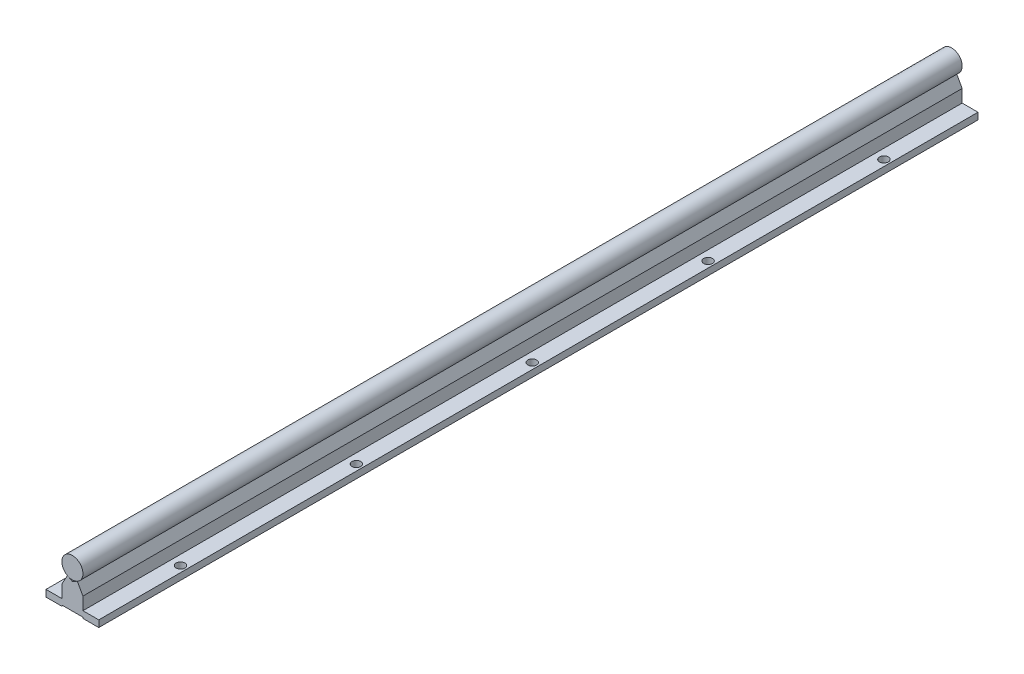
ISO-10303-21;
HEADER;
FILE_DESCRIPTION(('STEP AP214'),'2;1');
FILE_NAME('part.step','',(''),(''),'','','');
FILE_SCHEMA(('AUTOMOTIVE_DESIGN { 1 0 10303 214 1 1 1 1 }'));
ENDSEC;
DATA;
#1=APPLICATION_CONTEXT('core data for automotive mechanical design processes');
#2=APPLICATION_PROTOCOL_DEFINITION('international standard','automotive_design',2000,#1);
#3=PRODUCT_CONTEXT('',#1,'mechanical');
#4=PRODUCT('Part','Part','',(#3));
#5=PRODUCT_RELATED_PRODUCT_CATEGORY('part','',(#4));
#6=PRODUCT_DEFINITION_FORMATION('','',#4);
#7=PRODUCT_DEFINITION_CONTEXT('part definition',#1,'design');
#8=PRODUCT_DEFINITION('design','',#6,#7);
#9=PRODUCT_DEFINITION_SHAPE('','',#8);
#10=(LENGTH_UNIT() NAMED_UNIT(*) SI_UNIT(.MILLI.,.METRE.));
#11=(NAMED_UNIT(*) PLANE_ANGLE_UNIT() SI_UNIT($,.RADIAN.));
#12=(NAMED_UNIT(*) SI_UNIT($,.STERADIAN.) SOLID_ANGLE_UNIT());
#13=UNCERTAINTY_MEASURE_WITH_UNIT(LENGTH_MEASURE(1.E-05),#10,'distance_accuracy_value','');
#14=(GEOMETRIC_REPRESENTATION_CONTEXT(3) GLOBAL_UNCERTAINTY_ASSIGNED_CONTEXT((#13)) GLOBAL_UNIT_ASSIGNED_CONTEXT((#10,
#11,#12)) REPRESENTATION_CONTEXT('',''));
#15=CARTESIAN_POINT('',(0.,0.,0.));
#16=DIRECTION('',(0.,0.,1.));
#17=DIRECTION('',(1.,0.,0.));
#18=AXIS2_PLACEMENT_3D('',#15,#16,#17);
#19=CARTESIAN_POINT('',(0.,0.,500.));
#20=DIRECTION('',(0.,0.,-1.));
#21=DIRECTION('',(-1.,0.,0.));
#22=AXIS2_PLACEMENT_3D('',#19,#20,#21);
#23=CYLINDRICAL_SURFACE('',#22,6.);
#24=CARTESIAN_POINT('',(0.,0.,500.));
#25=DIRECTION('',(0.,0.,1.));
#26=DIRECTION('',(1.,0.,0.));
#27=AXIS2_PLACEMENT_3D('',#24,#25,#26);
#28=CIRCLE('',#27,6.);
#29=CARTESIAN_POINT('',(6.,0.,500.));
#30=VERTEX_POINT('',#29);
#31=EDGE_CURVE('E12',#30,#30,#28,.T.);
#32=ORIENTED_EDGE('',*,*,#31,.F.);
#33=EDGE_LOOP('',(#32));
#34=FACE_BOUND('',#33,.T.);
#35=CARTESIAN_POINT('',(0.,0.,0.));
#36=DIRECTION('',(0.,0.,1.));
#37=DIRECTION('',(1.,0.,0.));
#38=AXIS2_PLACEMENT_3D('',#35,#36,#37);
#39=CIRCLE('',#38,6.);
#40=CARTESIAN_POINT('',(6.,0.,0.));
#41=VERTEX_POINT('',#40);
#42=EDGE_CURVE('E99',#41,#41,#39,.T.);
#43=ORIENTED_EDGE('',*,*,#42,.T.);
#44=EDGE_LOOP('',(#43));
#45=FACE_BOUND('',#44,.T.);
#46=ADVANCED_FACE('F96',(#34,#45),#23,.T.);
#47=CARTESIAN_POINT('',(0.,0.,500.));
#48=DIRECTION('',(0.,0.,1.));
#49=DIRECTION('',(1.,0.,0.));
#50=AXIS2_PLACEMENT_3D('',#47,#48,#49);
#51=PLANE('',#50);
#52=ORIENTED_EDGE('',*,*,#31,.T.);
#53=EDGE_LOOP('',(#52));
#54=FACE_BOUND('',#53,.T.);
#55=ADVANCED_FACE('F111',(#54),#51,.T.);
#56=CARTESIAN_POINT('',(0.,0.,0.));
#57=DIRECTION('',(0.,0.,1.));
#58=DIRECTION('',(1.,0.,0.));
#59=AXIS2_PLACEMENT_3D('',#56,#57,#58);
#60=PLANE('',#59);
#61=ORIENTED_EDGE('',*,*,#42,.F.);
#62=EDGE_LOOP('',(#61));
#63=FACE_BOUND('',#62,.T.);
#64=ADVANCED_FACE('F109',(#63),#60,.F.);
#65=CLOSED_SHELL('',(#46,#55,#64));
#66=MANIFOLD_SOLID_BREP('B2',#65);
#67=CARTESIAN_POINT('',(2.82352941176471,-5.29411764705882,500.));
#68=DIRECTION('',(-0.470588235294118,0.88235294117647,0.));
#69=DIRECTION('',(-0.88235294117647,-0.470588235294118,0.));
#70=AXIS2_PLACEMENT_3D('',#67,#68,#69);
#71=PLANE('',#70);
#72=DIRECTION('',(0.88235294117647,0.470588235294118,0.));
#73=VECTOR('',#72,1.);
#74=CARTESIAN_POINT('',(2.82352941176471,-5.29411764705882,0.));
#75=LINE('',#74,#73);
#76=CARTESIAN_POINT('',(0.,-6.8,0.));
#77=VERTEX_POINT('',#76);
#78=CARTESIAN_POINT('',(2.82352941176471,-5.29411764705882,0.));
#79=VERTEX_POINT('',#78);
#80=EDGE_CURVE('E277',#77,#79,#75,.T.);
#81=ORIENTED_EDGE('',*,*,#80,.F.);
#82=DIRECTION('',(0.,0.,-1.));
#83=VECTOR('',#82,1.);
#84=CARTESIAN_POINT('',(0.,-6.8,500.));
#85=LINE('',#84,#83);
#86=CARTESIAN_POINT('',(0.,-6.8,500.));
#87=VERTEX_POINT('',#86);
#88=EDGE_CURVE('E94',#87,#77,#85,.T.);
#89=ORIENTED_EDGE('',*,*,#88,.F.);
#90=DIRECTION('',(0.88235294117647,0.470588235294118,0.));
#91=VECTOR('',#90,1.);
#92=CARTESIAN_POINT('',(2.82352941176471,-5.29411764705882,500.));
#93=LINE('',#92,#91);
#94=CARTESIAN_POINT('',(2.82352941176471,-5.29411764705882,500.));
#95=VERTEX_POINT('',#94);
#96=EDGE_CURVE('E313',#87,#95,#93,.T.);
#97=ORIENTED_EDGE('',*,*,#96,.T.);
#98=DIRECTION('',(0.,0.,-1.));
#99=VECTOR('',#98,1.);
#100=CARTESIAN_POINT('',(2.82352941176471,-5.29411764705882,500.));
#101=LINE('',#100,#99);
#102=EDGE_CURVE('E158',#95,#79,#101,.T.);
#103=ORIENTED_EDGE('',*,*,#102,.T.);
#104=EDGE_LOOP('',(#81,#89,#97,#103));
#105=FACE_BOUND('',#104,.T.);
#106=ADVANCED_FACE('F142',(#105),#71,.T.);
#107=CARTESIAN_POINT('',(-2.82352941176471,-5.29411764705882,500.));
#108=DIRECTION('',(-0.470588235294118,-0.882352941176471,0.));
#109=DIRECTION('',(0.882352941176471,-0.470588235294118,0.));
#110=AXIS2_PLACEMENT_3D('',#107,#108,#109);
#111=PLANE('',#110);
#112=DIRECTION('',(-0.882352941176471,0.470588235294118,0.));
#113=VECTOR('',#112,1.);
#114=CARTESIAN_POINT('',(-2.82352941176471,-5.29411764705882,0.));
#115=LINE('',#114,#113);
#116=CARTESIAN_POINT('',(-2.82352941176471,-5.29411764705882,0.));
#117=VERTEX_POINT('',#116);
#118=EDGE_CURVE('E279',#77,#117,#115,.T.);
#119=ORIENTED_EDGE('',*,*,#118,.T.);
#120=DIRECTION('',(0.,0.,-1.));
#121=VECTOR('',#120,1.);
#122=CARTESIAN_POINT('',(-2.82352941176471,-5.29411764705882,500.));
#123=LINE('',#122,#121);
#124=CARTESIAN_POINT('',(-2.82352941176471,-5.29411764705882,500.));
#125=VERTEX_POINT('',#124);
#126=EDGE_CURVE('E150',#125,#117,#123,.T.);
#127=ORIENTED_EDGE('',*,*,#126,.F.);
#128=DIRECTION('',(-0.882352941176471,0.470588235294118,0.));
#129=VECTOR('',#128,1.);
#130=CARTESIAN_POINT('',(-2.82352941176471,-5.29411764705882,500.));
#131=LINE('',#130,#129);
#132=EDGE_CURVE('E503',#87,#125,#131,.T.);
#133=ORIENTED_EDGE('',*,*,#132,.F.);
#134=ORIENTED_EDGE('',*,*,#88,.T.);
#135=EDGE_LOOP('',(#119,#127,#133,#134));
#136=FACE_BOUND('',#135,.T.);
#137=ADVANCED_FACE('F398',(#136),#111,.F.);
#138=CARTESIAN_POINT('',(0.0944421906693702,-0.0525760649087215,500.));
#139=DIRECTION('',(0.873732057275427,-0.486407537039928,0.));
#140=DIRECTION('',(0.486407537039928,0.873732057275427,0.));
#141=AXIS2_PLACEMENT_3D('',#138,#139,#140);
#142=PLANE('',#141);
#143=DIRECTION('',(-0.486407537039928,-0.873732057275427,0.));
#144=VECTOR('',#143,1.);
#145=CARTESIAN_POINT('',(0.0944421906693702,-0.0525760649087215,0.));
#146=LINE('',#145,#144);
#147=CARTESIAN_POINT('',(-6.,-11.,0.));
#148=VERTEX_POINT('',#147);
#149=EDGE_CURVE('E282',#117,#148,#146,.T.);
#150=ORIENTED_EDGE('',*,*,#149,.T.);
#151=DIRECTION('',(0.,0.,-1.));
#152=VECTOR('',#151,1.);
#153=CARTESIAN_POINT('',(-6.,-11.,500.));
#154=LINE('',#153,#152);
#155=CARTESIAN_POINT('',(-6.,-11.,500.));
#156=VERTEX_POINT('',#155);
#157=EDGE_CURVE('E337',#156,#148,#154,.T.);
#158=ORIENTED_EDGE('',*,*,#157,.F.);
#159=DIRECTION('',(-0.486407537039928,-0.873732057275427,0.));
#160=VECTOR('',#159,1.);
#161=CARTESIAN_POINT('',(0.0944421906693702,-0.0525760649087215,500.));
#162=LINE('',#161,#160);
#163=EDGE_CURVE('E346',#125,#156,#162,.T.);
#164=ORIENTED_EDGE('',*,*,#163,.F.);
#165=ORIENTED_EDGE('',*,*,#126,.T.);
#166=EDGE_LOOP('',(#150,#158,#164,#165));
#167=FACE_BOUND('',#166,.T.);
#168=ADVANCED_FACE('F344',(#167),#142,.F.);
#169=CARTESIAN_POINT('',(-6.,0.,500.));
#170=DIRECTION('',(1.,0.,0.));
#171=DIRECTION('',(0.,1.,0.));
#172=AXIS2_PLACEMENT_3D('',#169,#170,#171);
#173=PLANE('',#172);
#174=DIRECTION('',(0.,-1.,0.));
#175=VECTOR('',#174,1.);
#176=CARTESIAN_POINT('',(-6.,0.,0.));
#177=LINE('',#176,#175);
#178=CARTESIAN_POINT('',(-6.,-18.2,0.));
#179=VERTEX_POINT('',#178);
#180=EDGE_CURVE('E284',#148,#179,#177,.T.);
#181=ORIENTED_EDGE('',*,*,#180,.T.);
#182=DIRECTION('',(0.,0.,-1.));
#183=VECTOR('',#182,1.);
#184=CARTESIAN_POINT('',(-6.,-18.2,500.));
#185=LINE('',#184,#183);
#186=CARTESIAN_POINT('',(-6.,-18.2,500.));
#187=VERTEX_POINT('',#186);
#188=EDGE_CURVE('E334',#187,#179,#185,.T.);
#189=ORIENTED_EDGE('',*,*,#188,.F.);
#190=DIRECTION('',(0.,-1.,0.));
#191=VECTOR('',#190,1.);
#192=CARTESIAN_POINT('',(-6.,0.,500.));
#193=LINE('',#192,#191);
#194=EDGE_CURVE('E365',#156,#187,#193,.T.);
#195=ORIENTED_EDGE('',*,*,#194,.F.);
#196=ORIENTED_EDGE('',*,*,#157,.T.);
#197=EDGE_LOOP('',(#181,#189,#195,#196));
#198=FACE_BOUND('',#197,.T.);
#199=ADVANCED_FACE('F356',(#198),#173,.F.);
#200=CARTESIAN_POINT('',(0.,-18.2,500.));
#201=DIRECTION('',(0.,-1.,0.));
#202=DIRECTION('',(1.,0.,0.));
#203=AXIS2_PLACEMENT_3D('',#200,#201,#202);
#204=PLANE('',#203);
#205=CARTESIAN_POINT('',(-11.4999999999989,-18.2,150.));
#206=DIRECTION('',(0.,1.,0.));
#207=DIRECTION('',(-1.,0.,0.));
#208=AXIS2_PLACEMENT_3D('',#205,#206,#207);
#209=CIRCLE('',#208,2.5);
#210=CARTESIAN_POINT('',(-13.9999999999989,-18.2,150.));
#211=VERTEX_POINT('',#210);
#212=EDGE_CURVE('E474',#211,#211,#209,.T.);
#213=ORIENTED_EDGE('',*,*,#212,.F.);
#214=EDGE_LOOP('',(#213));
#215=FACE_BOUND('',#214,.T.);
#216=CARTESIAN_POINT('',(-11.4999999999979,-18.2,250.));
#217=DIRECTION('',(0.,1.,0.));
#218=DIRECTION('',(-1.,0.,0.));
#219=AXIS2_PLACEMENT_3D('',#216,#217,#218);
#220=CIRCLE('',#219,2.5);
#221=CARTESIAN_POINT('',(-13.9999999999979,-18.2,250.));
#222=VERTEX_POINT('',#221);
#223=EDGE_CURVE('E482',#222,#222,#220,.T.);
#224=ORIENTED_EDGE('',*,*,#223,.F.);
#225=EDGE_LOOP('',(#224));
#226=FACE_BOUND('',#225,.T.);
#227=CARTESIAN_POINT('',(-11.4999999999968,-18.2,350.));
#228=DIRECTION('',(0.,1.,0.));
#229=DIRECTION('',(-1.,0.,0.));
#230=AXIS2_PLACEMENT_3D('',#227,#228,#229);
#231=CIRCLE('',#230,2.5);
#232=CARTESIAN_POINT('',(-13.9999999999969,-18.2,350.));
#233=VERTEX_POINT('',#232);
#234=EDGE_CURVE('E488',#233,#233,#231,.T.);
#235=ORIENTED_EDGE('',*,*,#234,.F.);
#236=EDGE_LOOP('',(#235));
#237=FACE_BOUND('',#236,.T.);
#238=CARTESIAN_POINT('',(-11.4999999999958,-18.2,450.));
#239=DIRECTION('',(0.,1.,0.));
#240=DIRECTION('',(-1.,0.,0.));
#241=AXIS2_PLACEMENT_3D('',#238,#239,#240);
#242=CIRCLE('',#241,2.5);
#243=CARTESIAN_POINT('',(-13.9999999999958,-18.2,450.));
#244=VERTEX_POINT('',#243);
#245=EDGE_CURVE('E466',#244,#244,#242,.T.);
#246=ORIENTED_EDGE('',*,*,#245,.F.);
#247=EDGE_LOOP('',(#246));
#248=FACE_BOUND('',#247,.T.);
#249=CARTESIAN_POINT('',(-11.5,-18.2,50.));
#250=DIRECTION('',(0.,1.,0.));
#251=DIRECTION('',(-1.,0.,0.));
#252=AXIS2_PLACEMENT_3D('',#249,#250,#251);
#253=CIRCLE('',#252,2.5);
#254=CARTESIAN_POINT('',(-14.,-18.2,50.));
#255=VERTEX_POINT('',#254);
#256=EDGE_CURVE('E481',#255,#255,#253,.T.);
#257=ORIENTED_EDGE('',*,*,#256,.F.);
#258=EDGE_LOOP('',(#257));
#259=FACE_BOUND('',#258,.T.);
#260=DIRECTION('',(-1.,0.,0.));
#261=VECTOR('',#260,1.);
#262=CARTESIAN_POINT('',(0.,-18.2,0.));
#263=LINE('',#262,#261);
#264=CARTESIAN_POINT('',(-15.,-18.2,0.));
#265=VERTEX_POINT('',#264);
#266=EDGE_CURVE('E286',#179,#265,#263,.T.);
#267=ORIENTED_EDGE('',*,*,#266,.T.);
#268=DIRECTION('',(0.,0.,-1.));
#269=VECTOR('',#268,1.);
#270=CARTESIAN_POINT('',(-15.,-18.2,500.));
#271=LINE('',#270,#269);
#272=CARTESIAN_POINT('',(-15.,-18.2,500.));
#273=VERTEX_POINT('',#272);
#274=EDGE_CURVE('E331',#273,#265,#271,.T.);
#275=ORIENTED_EDGE('',*,*,#274,.F.);
#276=DIRECTION('',(-1.,0.,0.));
#277=VECTOR('',#276,1.);
#278=CARTESIAN_POINT('',(0.,-18.2,500.));
#279=LINE('',#278,#277);
#280=EDGE_CURVE('E362',#187,#273,#279,.T.);
#281=ORIENTED_EDGE('',*,*,#280,.F.);
#282=ORIENTED_EDGE('',*,*,#188,.T.);
#283=EDGE_LOOP('',(#267,#275,#281,#282));
#284=FACE_BOUND('',#283,.T.);
#285=ADVANCED_FACE('F360',(#215,#226,#237,#248,#259,#284),#204,.F.);
#286=CARTESIAN_POINT('',(-15.,0.,500.));
#287=DIRECTION('',(1.,0.,0.));
#288=DIRECTION('',(0.,1.,0.));
#289=AXIS2_PLACEMENT_3D('',#286,#287,#288);
#290=PLANE('',#289);
#291=DIRECTION('',(0.,-1.,0.));
#292=VECTOR('',#291,1.);
#293=CARTESIAN_POINT('',(-15.,0.,0.));
#294=LINE('',#293,#292);
#295=CARTESIAN_POINT('',(-15.,-22.,0.));
#296=VERTEX_POINT('',#295);
#297=EDGE_CURVE('E288',#265,#296,#294,.T.);
#298=ORIENTED_EDGE('',*,*,#297,.T.);
#299=DIRECTION('',(0.,0.,-1.));
#300=VECTOR('',#299,1.);
#301=CARTESIAN_POINT('',(-15.,-22.,500.));
#302=LINE('',#301,#300);
#303=CARTESIAN_POINT('',(-15.,-22.,500.));
#304=VERTEX_POINT('',#303);
#305=EDGE_CURVE('E329',#304,#296,#302,.T.);
#306=ORIENTED_EDGE('',*,*,#305,.F.);
#307=DIRECTION('',(0.,-1.,0.));
#308=VECTOR('',#307,1.);
#309=CARTESIAN_POINT('',(-15.,0.,500.));
#310=LINE('',#309,#308);
#311=EDGE_CURVE('E364',#273,#304,#310,.T.);
#312=ORIENTED_EDGE('',*,*,#311,.F.);
#313=ORIENTED_EDGE('',*,*,#274,.T.);
#314=EDGE_LOOP('',(#298,#306,#312,#313));
#315=FACE_BOUND('',#314,.T.);
#316=ADVANCED_FACE('F411',(#315),#290,.F.);
#317=CARTESIAN_POINT('',(0.,-22.,500.));
#318=DIRECTION('',(0.,-1.,0.));
#319=DIRECTION('',(1.,0.,0.));
#320=AXIS2_PLACEMENT_3D('',#317,#318,#319);
#321=PLANE('',#320);
#322=CARTESIAN_POINT('',(-11.4999999999989,-22.,150.));
#323=DIRECTION('',(0.,-1.,0.));
#324=DIRECTION('',(1.,0.,0.));
#325=AXIS2_PLACEMENT_3D('',#322,#323,#324);
#326=CIRCLE('',#325,2.5);
#327=CARTESIAN_POINT('',(-8.99999999999894,-22.,150.));
#328=VERTEX_POINT('',#327);
#329=EDGE_CURVE('E477',#328,#328,#326,.F.);
#330=ORIENTED_EDGE('',*,*,#329,.T.);
#331=EDGE_LOOP('',(#330));
#332=FACE_BOUND('',#331,.T.);
#333=CARTESIAN_POINT('',(-11.4999999999979,-22.,250.));
#334=DIRECTION('',(0.,-1.,0.));
#335=DIRECTION('',(1.,0.,0.));
#336=AXIS2_PLACEMENT_3D('',#333,#334,#335);
#337=CIRCLE('',#336,2.5);
#338=CARTESIAN_POINT('',(-8.99999999999789,-22.,250.));
#339=VERTEX_POINT('',#338);
#340=EDGE_CURVE('E478',#339,#339,#337,.F.);
#341=ORIENTED_EDGE('',*,*,#340,.T.);
#342=EDGE_LOOP('',(#341));
#343=FACE_BOUND('',#342,.T.);
#344=CARTESIAN_POINT('',(-11.4999999999968,-22.,350.));
#345=DIRECTION('',(0.,-1.,0.));
#346=DIRECTION('',(1.,0.,0.));
#347=AXIS2_PLACEMENT_3D('',#344,#345,#346);
#348=CIRCLE('',#347,2.5);
#349=CARTESIAN_POINT('',(-8.99999999999685,-22.,350.));
#350=VERTEX_POINT('',#349);
#351=EDGE_CURVE('E485',#350,#350,#348,.F.);
#352=ORIENTED_EDGE('',*,*,#351,.T.);
#353=EDGE_LOOP('',(#352));
#354=FACE_BOUND('',#353,.T.);
#355=CARTESIAN_POINT('',(-11.4999999999958,-22.,450.));
#356=DIRECTION('',(0.,-1.,0.));
#357=DIRECTION('',(1.,0.,0.));
#358=AXIS2_PLACEMENT_3D('',#355,#356,#357);
#359=CIRCLE('',#358,2.5);
#360=CARTESIAN_POINT('',(-8.9999999999958,-22.,450.));
#361=VERTEX_POINT('',#360);
#362=EDGE_CURVE('E491',#361,#361,#359,.F.);
#363=ORIENTED_EDGE('',*,*,#362,.T.);
#364=EDGE_LOOP('',(#363));
#365=FACE_BOUND('',#364,.T.);
#366=CARTESIAN_POINT('',(-11.5,-22.,50.));
#367=DIRECTION('',(0.,-1.,0.));
#368=DIRECTION('',(1.,0.,0.));
#369=AXIS2_PLACEMENT_3D('',#366,#367,#368);
#370=CIRCLE('',#369,2.5);
#371=CARTESIAN_POINT('',(-8.99999999999999,-22.,50.));
#372=VERTEX_POINT('',#371);
#373=EDGE_CURVE('E280',#372,#372,#370,.F.);
#374=ORIENTED_EDGE('',*,*,#373,.T.);
#375=EDGE_LOOP('',(#374));
#376=FACE_BOUND('',#375,.T.);
#377=DIRECTION('',(-1.,0.,0.));
#378=VECTOR('',#377,1.);
#379=CARTESIAN_POINT('',(0.,-22.,0.));
#380=LINE('',#379,#378);
#381=CARTESIAN_POINT('',(-6.,-22.,0.));
#382=VERTEX_POINT('',#381);
#383=EDGE_CURVE('E291',#382,#296,#380,.T.);
#384=ORIENTED_EDGE('',*,*,#383,.F.);
#385=DIRECTION('',(0.,0.,-1.));
#386=VECTOR('',#385,1.);
#387=CARTESIAN_POINT('',(-6.,-22.,500.));
#388=LINE('',#387,#386);
#389=CARTESIAN_POINT('',(-6.,-22.,500.));
#390=VERTEX_POINT('',#389);
#391=EDGE_CURVE('E327',#390,#382,#388,.T.);
#392=ORIENTED_EDGE('',*,*,#391,.F.);
#393=DIRECTION('',(-1.,0.,0.));
#394=VECTOR('',#393,1.);
#395=CARTESIAN_POINT('',(0.,-22.,500.));
#396=LINE('',#395,#394);
#397=EDGE_CURVE('E367',#390,#304,#396,.T.);
#398=ORIENTED_EDGE('',*,*,#397,.T.);
#399=ORIENTED_EDGE('',*,*,#305,.T.);
#400=EDGE_LOOP('',(#384,#392,#398,#399));
#401=FACE_BOUND('',#400,.T.);
#402=ADVANCED_FACE('F415',(#332,#343,#354,#365,#376,#401),#321,.T.);
#403=CARTESIAN_POINT('',(-5.99999999999997,0.,500.));
#404=DIRECTION('',(1.,0.,0.));
#405=DIRECTION('',(0.,1.,0.));
#406=AXIS2_PLACEMENT_3D('',#403,#404,#405);
#407=PLANE('',#406);
#408=DIRECTION('',(0.,-1.,0.));
#409=VECTOR('',#408,1.);
#410=CARTESIAN_POINT('',(-5.99999999999997,0.,0.));
#411=LINE('',#410,#409);
#412=CARTESIAN_POINT('',(-6.,-21.4,0.));
#413=VERTEX_POINT('',#412);
#414=EDGE_CURVE('E294',#413,#382,#411,.T.);
#415=ORIENTED_EDGE('',*,*,#414,.F.);
#416=DIRECTION('',(0.,0.,-1.));
#417=VECTOR('',#416,1.);
#418=CARTESIAN_POINT('',(-6.,-21.4,500.));
#419=LINE('',#418,#417);
#420=CARTESIAN_POINT('',(-6.,-21.4,500.));
#421=VERTEX_POINT('',#420);
#422=EDGE_CURVE('E325',#421,#413,#419,.T.);
#423=ORIENTED_EDGE('',*,*,#422,.F.);
#424=DIRECTION('',(0.,-1.,0.));
#425=VECTOR('',#424,1.);
#426=CARTESIAN_POINT('',(-5.99999999999997,0.,500.));
#427=LINE('',#426,#425);
#428=EDGE_CURVE('E374',#421,#390,#427,.T.);
#429=ORIENTED_EDGE('',*,*,#428,.T.);
#430=ORIENTED_EDGE('',*,*,#391,.T.);
#431=EDGE_LOOP('',(#415,#423,#429,#430));
#432=FACE_BOUND('',#431,.T.);
#433=ADVANCED_FACE('F419',(#432),#407,.T.);
#434=CARTESIAN_POINT('',(0.,-21.4,500.));
#435=DIRECTION('',(0.,1.,0.));
#436=DIRECTION('',(0.,0.,1.));
#437=AXIS2_PLACEMENT_3D('',#434,#435,#436);
#438=PLANE('',#437);
#439=DIRECTION('',(1.,0.,0.));
#440=VECTOR('',#439,1.);
#441=CARTESIAN_POINT('',(0.,-21.4,0.));
#442=LINE('',#441,#440);
#443=CARTESIAN_POINT('',(6.,-21.4,0.));
#444=VERTEX_POINT('',#443);
#445=EDGE_CURVE('E297',#413,#444,#442,.T.);
#446=ORIENTED_EDGE('',*,*,#445,.T.);
#447=DIRECTION('',(0.,0.,-1.));
#448=VECTOR('',#447,1.);
#449=CARTESIAN_POINT('',(6.,-21.4,500.));
#450=LINE('',#449,#448);
#451=CARTESIAN_POINT('',(6.,-21.4,500.));
#452=VERTEX_POINT('',#451);
#453=EDGE_CURVE('E322',#452,#444,#450,.T.);
#454=ORIENTED_EDGE('',*,*,#453,.F.);
#455=DIRECTION('',(1.,0.,0.));
#456=VECTOR('',#455,1.);
#457=CARTESIAN_POINT('',(0.,-21.4,500.));
#458=LINE('',#457,#456);
#459=EDGE_CURVE('E377',#421,#452,#458,.T.);
#460=ORIENTED_EDGE('',*,*,#459,.F.);
#461=ORIENTED_EDGE('',*,*,#422,.T.);
#462=EDGE_LOOP('',(#446,#454,#460,#461));
#463=FACE_BOUND('',#462,.T.);
#464=ADVANCED_FACE('F423',(#463),#438,.F.);
#465=CARTESIAN_POINT('',(5.99999999999997,0.,500.));
#466=DIRECTION('',(1.,0.,0.));
#467=DIRECTION('',(0.,1.,0.));
#468=AXIS2_PLACEMENT_3D('',#465,#466,#467);
#469=PLANE('',#468);
#470=DIRECTION('',(0.,-1.,0.));
#471=VECTOR('',#470,1.);
#472=CARTESIAN_POINT('',(5.99999999999997,0.,0.));
#473=LINE('',#472,#471);
#474=CARTESIAN_POINT('',(6.,-22.,0.));
#475=VERTEX_POINT('',#474);
#476=EDGE_CURVE('E299',#444,#475,#473,.T.);
#477=ORIENTED_EDGE('',*,*,#476,.T.);
#478=DIRECTION('',(0.,0.,-1.));
#479=VECTOR('',#478,1.);
#480=CARTESIAN_POINT('',(6.,-22.,500.));
#481=LINE('',#480,#479);
#482=CARTESIAN_POINT('',(6.,-22.,500.));
#483=VERTEX_POINT('',#482);
#484=EDGE_CURVE('E319',#483,#475,#481,.T.);
#485=ORIENTED_EDGE('',*,*,#484,.F.);
#486=DIRECTION('',(0.,-1.,0.));
#487=VECTOR('',#486,1.);
#488=CARTESIAN_POINT('',(5.99999999999997,0.,500.));
#489=LINE('',#488,#487);
#490=EDGE_CURVE('E379',#452,#483,#489,.T.);
#491=ORIENTED_EDGE('',*,*,#490,.F.);
#492=ORIENTED_EDGE('',*,*,#453,.T.);
#493=EDGE_LOOP('',(#477,#485,#491,#492));
#494=FACE_BOUND('',#493,.T.);
#495=ADVANCED_FACE('F427',(#494),#469,.F.);
#496=CARTESIAN_POINT('',(0.,-22.,500.));
#497=DIRECTION('',(0.,1.,0.));
#498=DIRECTION('',(0.,0.,1.));
#499=AXIS2_PLACEMENT_3D('',#496,#497,#498);
#500=PLANE('',#499);
#501=CARTESIAN_POINT('',(11.4999999999989,-22.,150.));
#502=DIRECTION('',(0.,-1.,0.));
#503=DIRECTION('',(1.,0.,0.));
#504=AXIS2_PLACEMENT_3D('',#501,#502,#503);
#505=CIRCLE('',#504,2.5);
#506=CARTESIAN_POINT('',(13.9999999999989,-22.,150.));
#507=VERTEX_POINT('',#506);
#508=EDGE_CURVE('E463',#507,#507,#505,.T.);
#509=ORIENTED_EDGE('',*,*,#508,.F.);
#510=EDGE_LOOP('',(#509));
#511=FACE_BOUND('',#510,.T.);
#512=CARTESIAN_POINT('',(11.4999999999979,-22.,250.));
#513=DIRECTION('',(0.,-1.,0.));
#514=DIRECTION('',(1.,0.,0.));
#515=AXIS2_PLACEMENT_3D('',#512,#513,#514);
#516=CIRCLE('',#515,2.5);
#517=CARTESIAN_POINT('',(13.9999999999979,-22.,250.));
#518=VERTEX_POINT('',#517);
#519=EDGE_CURVE('E558',#518,#518,#516,.T.);
#520=ORIENTED_EDGE('',*,*,#519,.F.);
#521=EDGE_LOOP('',(#520));
#522=FACE_BOUND('',#521,.T.);
#523=CARTESIAN_POINT('',(11.4999999999968,-22.,350.));
#524=DIRECTION('',(0.,-1.,0.));
#525=DIRECTION('',(1.,0.,0.));
#526=AXIS2_PLACEMENT_3D('',#523,#524,#525);
#527=CIRCLE('',#526,2.5);
#528=CARTESIAN_POINT('',(13.9999999999968,-22.,350.));
#529=VERTEX_POINT('',#528);
#530=EDGE_CURVE('E562',#529,#529,#527,.T.);
#531=ORIENTED_EDGE('',*,*,#530,.F.);
#532=EDGE_LOOP('',(#531));
#533=FACE_BOUND('',#532,.T.);
#534=CARTESIAN_POINT('',(11.4999999999958,-22.,450.));
#535=DIRECTION('',(0.,-1.,0.));
#536=DIRECTION('',(1.,0.,0.));
#537=AXIS2_PLACEMENT_3D('',#534,#535,#536);
#538=CIRCLE('',#537,2.5);
#539=CARTESIAN_POINT('',(13.9999999999958,-22.,450.));
#540=VERTEX_POINT('',#539);
#541=EDGE_CURVE('E471',#540,#540,#538,.T.);
#542=ORIENTED_EDGE('',*,*,#541,.F.);
#543=EDGE_LOOP('',(#542));
#544=FACE_BOUND('',#543,.T.);
#545=CARTESIAN_POINT('',(11.5,-22.,50.));
#546=DIRECTION('',(0.,-1.,0.));
#547=DIRECTION('',(1.,0.,0.));
#548=AXIS2_PLACEMENT_3D('',#545,#546,#547);
#549=CIRCLE('',#548,2.5);
#550=CARTESIAN_POINT('',(14.,-22.,50.));
#551=VERTEX_POINT('',#550);
#552=EDGE_CURVE('E462',#551,#551,#549,.T.);
#553=ORIENTED_EDGE('',*,*,#552,.F.);
#554=EDGE_LOOP('',(#553));
#555=FACE_BOUND('',#554,.T.);
#556=DIRECTION('',(1.,0.,0.));
#557=VECTOR('',#556,1.);
#558=CARTESIAN_POINT('',(0.,-22.,0.));
#559=LINE('',#558,#557);
#560=CARTESIAN_POINT('',(15.,-22.,0.));
#561=VERTEX_POINT('',#560);
#562=EDGE_CURVE('E301',#475,#561,#559,.T.);
#563=ORIENTED_EDGE('',*,*,#562,.T.);
#564=DIRECTION('',(0.,0.,-1.));
#565=VECTOR('',#564,1.);
#566=CARTESIAN_POINT('',(15.,-22.,500.));
#567=LINE('',#566,#565);
#568=CARTESIAN_POINT('',(15.,-22.,500.));
#569=VERTEX_POINT('',#568);
#570=EDGE_CURVE('E317',#569,#561,#567,.T.);
#571=ORIENTED_EDGE('',*,*,#570,.F.);
#572=DIRECTION('',(1.,0.,0.));
#573=VECTOR('',#572,1.);
#574=CARTESIAN_POINT('',(0.,-22.,500.));
#575=LINE('',#574,#573);
#576=EDGE_CURVE('E381',#483,#569,#575,.T.);
#577=ORIENTED_EDGE('',*,*,#576,.F.);
#578=ORIENTED_EDGE('',*,*,#484,.T.);
#579=EDGE_LOOP('',(#563,#571,#577,#578));
#580=FACE_BOUND('',#579,.T.);
#581=ADVANCED_FACE('F431',(#511,#522,#533,#544,#555,#580),#500,.F.);
#582=CARTESIAN_POINT('',(15.,0.,500.));
#583=DIRECTION('',(1.,0.,0.));
#584=DIRECTION('',(0.,1.,0.));
#585=AXIS2_PLACEMENT_3D('',#582,#583,#584);
#586=PLANE('',#585);
#587=DIRECTION('',(0.,-1.,0.));
#588=VECTOR('',#587,1.);
#589=CARTESIAN_POINT('',(15.,0.,0.));
#590=LINE('',#589,#588);
#591=CARTESIAN_POINT('',(15.,-18.2,0.));
#592=VERTEX_POINT('',#591);
#593=EDGE_CURVE('E304',#592,#561,#590,.T.);
#594=ORIENTED_EDGE('',*,*,#593,.F.);
#595=DIRECTION('',(0.,0.,-1.));
#596=VECTOR('',#595,1.);
#597=CARTESIAN_POINT('',(15.,-18.2,500.));
#598=LINE('',#597,#596);
#599=CARTESIAN_POINT('',(15.,-18.2,500.));
#600=VERTEX_POINT('',#599);
#601=EDGE_CURVE('E259',#600,#592,#598,.T.);
#602=ORIENTED_EDGE('',*,*,#601,.F.);
#603=DIRECTION('',(0.,-1.,0.));
#604=VECTOR('',#603,1.);
#605=CARTESIAN_POINT('',(15.,0.,500.));
#606=LINE('',#605,#604);
#607=EDGE_CURVE('E269',#600,#569,#606,.T.);
#608=ORIENTED_EDGE('',*,*,#607,.T.);
#609=ORIENTED_EDGE('',*,*,#570,.T.);
#610=EDGE_LOOP('',(#594,#602,#608,#609));
#611=FACE_BOUND('',#610,.T.);
#612=ADVANCED_FACE('F384',(#611),#586,.T.);
#613=CARTESIAN_POINT('',(0.,-18.2,500.));
#614=DIRECTION('',(0.,1.,0.));
#615=DIRECTION('',(0.,0.,1.));
#616=AXIS2_PLACEMENT_3D('',#613,#614,#615);
#617=PLANE('',#616);
#618=CARTESIAN_POINT('',(11.4999999999989,-18.2,150.));
#619=DIRECTION('',(0.,-1.,0.));
#620=DIRECTION('',(1.,0.,0.));
#621=AXIS2_PLACEMENT_3D('',#618,#619,#620);
#622=CIRCLE('',#621,2.5);
#623=CARTESIAN_POINT('',(13.9999999999989,-18.2,150.));
#624=VERTEX_POINT('',#623);
#625=EDGE_CURVE('E445',#624,#624,#622,.T.);
#626=ORIENTED_EDGE('',*,*,#625,.T.);
#627=EDGE_LOOP('',(#626));
#628=FACE_BOUND('',#627,.T.);
#629=CARTESIAN_POINT('',(11.4999999999979,-18.2,250.));
#630=DIRECTION('',(0.,-1.,0.));
#631=DIRECTION('',(1.,0.,0.));
#632=AXIS2_PLACEMENT_3D('',#629,#630,#631);
#633=CIRCLE('',#632,2.5);
#634=CARTESIAN_POINT('',(13.9999999999979,-18.2,250.));
#635=VERTEX_POINT('',#634);
#636=EDGE_CURVE('E449',#635,#635,#633,.T.);
#637=ORIENTED_EDGE('',*,*,#636,.T.);
#638=EDGE_LOOP('',(#637));
#639=FACE_BOUND('',#638,.T.);
#640=CARTESIAN_POINT('',(11.4999999999968,-18.2,350.));
#641=DIRECTION('',(0.,-1.,0.));
#642=DIRECTION('',(1.,0.,0.));
#643=AXIS2_PLACEMENT_3D('',#640,#641,#642);
#644=CIRCLE('',#643,2.5);
#645=CARTESIAN_POINT('',(13.9999999999969,-18.2,350.));
#646=VERTEX_POINT('',#645);
#647=EDGE_CURVE('E453',#646,#646,#644,.T.);
#648=ORIENTED_EDGE('',*,*,#647,.T.);
#649=EDGE_LOOP('',(#648));
#650=FACE_BOUND('',#649,.T.);
#651=CARTESIAN_POINT('',(11.4999999999958,-18.2,450.));
#652=DIRECTION('',(0.,-1.,0.));
#653=DIRECTION('',(1.,0.,0.));
#654=AXIS2_PLACEMENT_3D('',#651,#652,#653);
#655=CIRCLE('',#654,2.5);
#656=CARTESIAN_POINT('',(13.9999999999958,-18.2,450.));
#657=VERTEX_POINT('',#656);
#658=EDGE_CURVE('E457',#657,#657,#655,.T.);
#659=ORIENTED_EDGE('',*,*,#658,.T.);
#660=EDGE_LOOP('',(#659));
#661=FACE_BOUND('',#660,.T.);
#662=CARTESIAN_POINT('',(11.5,-18.2,50.));
#663=DIRECTION('',(0.,-1.,0.));
#664=DIRECTION('',(1.,0.,0.));
#665=AXIS2_PLACEMENT_3D('',#662,#663,#664);
#666=CIRCLE('',#665,2.5);
#667=CARTESIAN_POINT('',(14.,-18.2,50.));
#668=VERTEX_POINT('',#667);
#669=EDGE_CURVE('E460',#668,#668,#666,.T.);
#670=ORIENTED_EDGE('',*,*,#669,.T.);
#671=EDGE_LOOP('',(#670));
#672=FACE_BOUND('',#671,.T.);
#673=DIRECTION('',(1.,0.,0.));
#674=VECTOR('',#673,1.);
#675=CARTESIAN_POINT('',(0.,-18.2,0.));
#676=LINE('',#675,#674);
#677=CARTESIAN_POINT('',(6.,-18.2,0.));
#678=VERTEX_POINT('',#677);
#679=EDGE_CURVE('E255',#678,#592,#676,.T.);
#680=ORIENTED_EDGE('',*,*,#679,.F.);
#681=DIRECTION('',(0.,0.,-1.));
#682=VECTOR('',#681,1.);
#683=CARTESIAN_POINT('',(6.,-18.2,500.));
#684=LINE('',#683,#682);
#685=CARTESIAN_POINT('',(6.,-18.2,500.));
#686=VERTEX_POINT('',#685);
#687=EDGE_CURVE('E250',#686,#678,#684,.T.);
#688=ORIENTED_EDGE('',*,*,#687,.F.);
#689=DIRECTION('',(1.,0.,0.));
#690=VECTOR('',#689,1.);
#691=CARTESIAN_POINT('',(0.,-18.2,500.));
#692=LINE('',#691,#690);
#693=EDGE_CURVE('E253',#686,#600,#692,.T.);
#694=ORIENTED_EDGE('',*,*,#693,.T.);
#695=ORIENTED_EDGE('',*,*,#601,.T.);
#696=EDGE_LOOP('',(#680,#688,#694,#695));
#697=FACE_BOUND('',#696,.T.);
#698=ADVANCED_FACE('F252',(#628,#639,#650,#661,#672,#697),#617,.T.);
#699=CARTESIAN_POINT('',(6.00000000000001,0.,500.));
#700=DIRECTION('',(1.,0.,0.));
#701=DIRECTION('',(0.,1.,0.));
#702=AXIS2_PLACEMENT_3D('',#699,#700,#701);
#703=PLANE('',#702);
#704=DIRECTION('',(0.,-1.,0.));
#705=VECTOR('',#704,1.);
#706=CARTESIAN_POINT('',(6.00000000000001,0.,0.));
#707=LINE('',#706,#705);
#708=CARTESIAN_POINT('',(6.,-11.,0.));
#709=VERTEX_POINT('',#708);
#710=EDGE_CURVE('E308',#709,#678,#707,.T.);
#711=ORIENTED_EDGE('',*,*,#710,.F.);
#712=DIRECTION('',(0.,0.,-1.));
#713=VECTOR('',#712,1.);
#714=CARTESIAN_POINT('',(6.,-11.,500.));
#715=LINE('',#714,#713);
#716=CARTESIAN_POINT('',(6.,-11.,500.));
#717=VERTEX_POINT('',#716);
#718=EDGE_CURVE('E204',#717,#709,#715,.T.);
#719=ORIENTED_EDGE('',*,*,#718,.F.);
#720=DIRECTION('',(0.,-1.,0.));
#721=VECTOR('',#720,1.);
#722=CARTESIAN_POINT('',(6.00000000000001,0.,500.));
#723=LINE('',#722,#721);
#724=EDGE_CURVE('E267',#717,#686,#723,.T.);
#725=ORIENTED_EDGE('',*,*,#724,.T.);
#726=ORIENTED_EDGE('',*,*,#687,.T.);
#727=EDGE_LOOP('',(#711,#719,#725,#726));
#728=FACE_BOUND('',#727,.T.);
#729=ADVANCED_FACE('F271',(#728),#703,.T.);
#730=CARTESIAN_POINT('',(-0.0944421906693717,-0.0525760649087224,500.));
#731=DIRECTION('',(0.873732057275427,0.486407537039929,0.));
#732=DIRECTION('',(-0.486407537039929,0.873732057275427,0.));
#733=AXIS2_PLACEMENT_3D('',#730,#731,#732);
#734=PLANE('',#733);
#735=DIRECTION('',(0.486407537039929,-0.873732057275427,0.));
#736=VECTOR('',#735,1.);
#737=CARTESIAN_POINT('',(-0.0944421906693717,-0.0525760649087224,0.));
#738=LINE('',#737,#736);
#739=EDGE_CURVE('E310',#79,#709,#738,.T.);
#740=ORIENTED_EDGE('',*,*,#739,.F.);
#741=ORIENTED_EDGE('',*,*,#102,.F.);
#742=DIRECTION('',(0.486407537039929,-0.873732057275427,0.));
#743=VECTOR('',#742,1.);
#744=CARTESIAN_POINT('',(-0.0944421906693717,-0.0525760649087224,500.));
#745=LINE('',#744,#743);
#746=EDGE_CURVE('E272',#95,#717,#745,.T.);
#747=ORIENTED_EDGE('',*,*,#746,.T.);
#748=ORIENTED_EDGE('',*,*,#718,.T.);
#749=EDGE_LOOP('',(#740,#741,#747,#748));
#750=FACE_BOUND('',#749,.T.);
#751=ADVANCED_FACE('F387',(#750),#734,.T.);
#752=CARTESIAN_POINT('',(0.,0.,500.));
#753=DIRECTION('',(0.,0.,1.));
#754=DIRECTION('',(1.,0.,0.));
#755=AXIS2_PLACEMENT_3D('',#752,#753,#754);
#756=PLANE('',#755);
#757=ORIENTED_EDGE('',*,*,#96,.F.);
#758=ORIENTED_EDGE('',*,*,#132,.T.);
#759=ORIENTED_EDGE('',*,*,#163,.T.);
#760=ORIENTED_EDGE('',*,*,#194,.T.);
#761=ORIENTED_EDGE('',*,*,#280,.T.);
#762=ORIENTED_EDGE('',*,*,#311,.T.);
#763=ORIENTED_EDGE('',*,*,#397,.F.);
#764=ORIENTED_EDGE('',*,*,#428,.F.);
#765=ORIENTED_EDGE('',*,*,#459,.T.);
#766=ORIENTED_EDGE('',*,*,#490,.T.);
#767=ORIENTED_EDGE('',*,*,#576,.T.);
#768=ORIENTED_EDGE('',*,*,#607,.F.);
#769=ORIENTED_EDGE('',*,*,#693,.F.);
#770=ORIENTED_EDGE('',*,*,#724,.F.);
#771=ORIENTED_EDGE('',*,*,#746,.F.);
#772=EDGE_LOOP('',(#757,#758,#759,#760,#761,#762,#763,#764,#765,#766,#767,#768,#769,#770,#771));
#773=FACE_BOUND('',#772,.T.);
#774=ADVANCED_FACE('F265',(#773),#756,.T.);
#775=CARTESIAN_POINT('',(0.,0.,0.));
#776=DIRECTION('',(0.,0.,1.));
#777=DIRECTION('',(1.,0.,0.));
#778=AXIS2_PLACEMENT_3D('',#775,#776,#777);
#779=PLANE('',#778);
#780=ORIENTED_EDGE('',*,*,#80,.T.);
#781=ORIENTED_EDGE('',*,*,#739,.T.);
#782=ORIENTED_EDGE('',*,*,#710,.T.);
#783=ORIENTED_EDGE('',*,*,#679,.T.);
#784=ORIENTED_EDGE('',*,*,#593,.T.);
#785=ORIENTED_EDGE('',*,*,#562,.F.);
#786=ORIENTED_EDGE('',*,*,#476,.F.);
#787=ORIENTED_EDGE('',*,*,#445,.F.);
#788=ORIENTED_EDGE('',*,*,#414,.T.);
#789=ORIENTED_EDGE('',*,*,#383,.T.);
#790=ORIENTED_EDGE('',*,*,#297,.F.);
#791=ORIENTED_EDGE('',*,*,#266,.F.);
#792=ORIENTED_EDGE('',*,*,#180,.F.);
#793=ORIENTED_EDGE('',*,*,#149,.F.);
#794=ORIENTED_EDGE('',*,*,#118,.F.);
#795=EDGE_LOOP('',(#780,#781,#782,#783,#784,#785,#786,#787,#788,#789,#790,#791,#792,#793,#794));
#796=FACE_BOUND('',#795,.T.);
#797=ADVANCED_FACE('F351',(#796),#779,.F.);
#798=CARTESIAN_POINT('',(-11.5,-29.0710678118655,50.));
#799=DIRECTION('',(0.,1.,0.));
#800=DIRECTION('',(-1.,0.,0.));
#801=AXIS2_PLACEMENT_3D('',#798,#799,#800);
#802=CYLINDRICAL_SURFACE('',#801,2.5);
#803=ORIENTED_EDGE('',*,*,#256,.T.);
#804=EDGE_LOOP('',(#803));
#805=FACE_BOUND('',#804,.T.);
#806=ORIENTED_EDGE('',*,*,#373,.F.);
#807=EDGE_LOOP('',(#806));
#808=FACE_BOUND('',#807,.T.);
#809=ADVANCED_FACE('F508',(#805,#808),#802,.F.);
#810=CARTESIAN_POINT('',(-11.4999999999958,-29.0710678118655,450.));
#811=DIRECTION('',(0.,1.,0.));
#812=DIRECTION('',(-1.,0.,0.));
#813=AXIS2_PLACEMENT_3D('',#810,#811,#812);
#814=CYLINDRICAL_SURFACE('',#813,2.5);
#815=ORIENTED_EDGE('',*,*,#245,.T.);
#816=EDGE_LOOP('',(#815));
#817=FACE_BOUND('',#816,.T.);
#818=ORIENTED_EDGE('',*,*,#362,.F.);
#819=EDGE_LOOP('',(#818));
#820=FACE_BOUND('',#819,.T.);
#821=ADVANCED_FACE('F510',(#817,#820),#814,.F.);
#822=CARTESIAN_POINT('',(-11.4999999999968,-29.0710678118655,350.));
#823=DIRECTION('',(0.,1.,0.));
#824=DIRECTION('',(-1.,0.,0.));
#825=AXIS2_PLACEMENT_3D('',#822,#823,#824);
#826=CYLINDRICAL_SURFACE('',#825,2.5);
#827=ORIENTED_EDGE('',*,*,#234,.T.);
#828=EDGE_LOOP('',(#827));
#829=FACE_BOUND('',#828,.T.);
#830=ORIENTED_EDGE('',*,*,#351,.F.);
#831=EDGE_LOOP('',(#830));
#832=FACE_BOUND('',#831,.T.);
#833=ADVANCED_FACE('F517',(#829,#832),#826,.F.);
#834=CARTESIAN_POINT('',(-11.4999999999979,-29.0710678118655,250.));
#835=DIRECTION('',(0.,1.,0.));
#836=DIRECTION('',(-1.,0.,0.));
#837=AXIS2_PLACEMENT_3D('',#834,#835,#836);
#838=CYLINDRICAL_SURFACE('',#837,2.5);
#839=ORIENTED_EDGE('',*,*,#223,.T.);
#840=EDGE_LOOP('',(#839));
#841=FACE_BOUND('',#840,.T.);
#842=ORIENTED_EDGE('',*,*,#340,.F.);
#843=EDGE_LOOP('',(#842));
#844=FACE_BOUND('',#843,.T.);
#845=ADVANCED_FACE('F523',(#841,#844),#838,.F.);
#846=CARTESIAN_POINT('',(-11.4999999999989,-29.0710678118655,150.));
#847=DIRECTION('',(0.,1.,0.));
#848=DIRECTION('',(-1.,0.,0.));
#849=AXIS2_PLACEMENT_3D('',#846,#847,#848);
#850=CYLINDRICAL_SURFACE('',#849,2.5);
#851=ORIENTED_EDGE('',*,*,#212,.T.);
#852=EDGE_LOOP('',(#851));
#853=FACE_BOUND('',#852,.T.);
#854=ORIENTED_EDGE('',*,*,#329,.F.);
#855=EDGE_LOOP('',(#854));
#856=FACE_BOUND('',#855,.T.);
#857=ADVANCED_FACE('F527',(#853,#856),#850,.F.);
#858=CARTESIAN_POINT('',(11.5,-29.0710678118655,50.));
#859=DIRECTION('',(0.,1.,0.));
#860=DIRECTION('',(-1.,0.,0.));
#861=AXIS2_PLACEMENT_3D('',#858,#859,#860);
#862=CYLINDRICAL_SURFACE('',#861,2.5);
#863=ORIENTED_EDGE('',*,*,#669,.F.);
#864=EDGE_LOOP('',(#863));
#865=FACE_BOUND('',#864,.T.);
#866=ORIENTED_EDGE('',*,*,#552,.T.);
#867=EDGE_LOOP('',(#866));
#868=FACE_BOUND('',#867,.T.);
#869=ADVANCED_FACE('F531',(#865,#868),#862,.F.);
#870=CARTESIAN_POINT('',(11.4999999999958,-29.0710678118655,450.));
#871=DIRECTION('',(0.,1.,0.));
#872=DIRECTION('',(-1.,0.,0.));
#873=AXIS2_PLACEMENT_3D('',#870,#871,#872);
#874=CYLINDRICAL_SURFACE('',#873,2.5);
#875=ORIENTED_EDGE('',*,*,#658,.F.);
#876=EDGE_LOOP('',(#875));
#877=FACE_BOUND('',#876,.T.);
#878=ORIENTED_EDGE('',*,*,#541,.T.);
#879=EDGE_LOOP('',(#878));
#880=FACE_BOUND('',#879,.T.);
#881=ADVANCED_FACE('F535',(#877,#880),#874,.F.);
#882=CARTESIAN_POINT('',(11.4999999999968,-29.0710678118655,350.));
#883=DIRECTION('',(0.,1.,0.));
#884=DIRECTION('',(-1.,0.,0.));
#885=AXIS2_PLACEMENT_3D('',#882,#883,#884);
#886=CYLINDRICAL_SURFACE('',#885,2.5);
#887=ORIENTED_EDGE('',*,*,#647,.F.);
#888=EDGE_LOOP('',(#887));
#889=FACE_BOUND('',#888,.T.);
#890=ORIENTED_EDGE('',*,*,#530,.T.);
#891=EDGE_LOOP('',(#890));
#892=FACE_BOUND('',#891,.T.);
#893=ADVANCED_FACE('F538',(#889,#892),#886,.F.);
#894=CARTESIAN_POINT('',(11.4999999999979,-29.0710678118655,250.));
#895=DIRECTION('',(0.,1.,0.));
#896=DIRECTION('',(-1.,0.,0.));
#897=AXIS2_PLACEMENT_3D('',#894,#895,#896);
#898=CYLINDRICAL_SURFACE('',#897,2.5);
#899=ORIENTED_EDGE('',*,*,#636,.F.);
#900=EDGE_LOOP('',(#899));
#901=FACE_BOUND('',#900,.T.);
#902=ORIENTED_EDGE('',*,*,#519,.T.);
#903=EDGE_LOOP('',(#902));
#904=FACE_BOUND('',#903,.T.);
#905=ADVANCED_FACE('F542',(#901,#904),#898,.F.);
#906=CARTESIAN_POINT('',(11.4999999999989,-29.0710678118655,150.));
#907=DIRECTION('',(0.,1.,0.));
#908=DIRECTION('',(-1.,0.,0.));
#909=AXIS2_PLACEMENT_3D('',#906,#907,#908);
#910=CYLINDRICAL_SURFACE('',#909,2.5);
#911=ORIENTED_EDGE('',*,*,#625,.F.);
#912=EDGE_LOOP('',(#911));
#913=FACE_BOUND('',#912,.T.);
#914=ORIENTED_EDGE('',*,*,#508,.T.);
#915=EDGE_LOOP('',(#914));
#916=FACE_BOUND('',#915,.T.);
#917=ADVANCED_FACE('F546',(#913,#916),#910,.F.);
#918=CLOSED_SHELL('',(#106,#137,#168,#199,#285,#316,#402,#433,#464,#495,#581,#612,#698,#729,
#751,#774,#797,#809,#821,#833,#845,#857,#869,#881,#893,#905,#917));
#919=MANIFOLD_SOLID_BREP('B7',#918);
#920=ADVANCED_BREP_SHAPE_REPRESENTATION('',(#18,#66,#919),#14);
#921=SHAPE_DEFINITION_REPRESENTATION(#9,#920);
ENDSEC;
END-ISO-10303-21;
